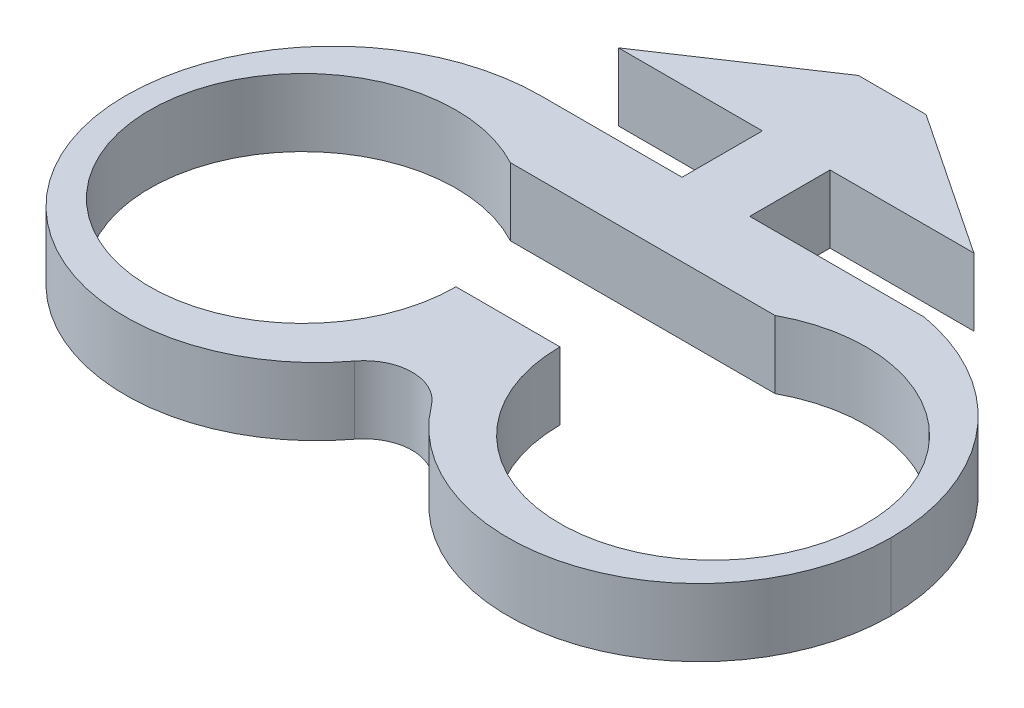
ISO-10303-21;
HEADER;
FILE_DESCRIPTION(('STEP AP214'),'2;1');
FILE_NAME('part.step','',(''),(''),'','','');
FILE_SCHEMA(('AUTOMOTIVE_DESIGN { 1 0 10303 214 1 1 1 1 }'));
ENDSEC;
DATA;
#1=APPLICATION_CONTEXT('core data for automotive mechanical design processes');
#2=APPLICATION_PROTOCOL_DEFINITION('international standard','automotive_design',2000,#1);
#3=PRODUCT_CONTEXT('',#1,'mechanical');
#4=PRODUCT('Part','Part','',(#3));
#5=PRODUCT_RELATED_PRODUCT_CATEGORY('part','',(#4));
#6=PRODUCT_DEFINITION_FORMATION('','',#4);
#7=PRODUCT_DEFINITION_CONTEXT('part definition',#1,'design');
#8=PRODUCT_DEFINITION('design','',#6,#7);
#9=PRODUCT_DEFINITION_SHAPE('','',#8);
#10=(LENGTH_UNIT() NAMED_UNIT(*) SI_UNIT(.MILLI.,.METRE.));
#11=(NAMED_UNIT(*) PLANE_ANGLE_UNIT() SI_UNIT($,.RADIAN.));
#12=(NAMED_UNIT(*) SI_UNIT($,.STERADIAN.) SOLID_ANGLE_UNIT());
#13=UNCERTAINTY_MEASURE_WITH_UNIT(LENGTH_MEASURE(1.E-05),#10,'distance_accuracy_value','');
#14=(GEOMETRIC_REPRESENTATION_CONTEXT(3) GLOBAL_UNCERTAINTY_ASSIGNED_CONTEXT((#13)) GLOBAL_UNIT_ASSIGNED_CONTEXT((#10,
#11,#12)) REPRESENTATION_CONTEXT('',''));
#15=CARTESIAN_POINT('',(0.,0.,0.));
#16=DIRECTION('',(0.,0.,1.));
#17=DIRECTION('',(1.,0.,0.));
#18=AXIS2_PLACEMENT_3D('',#15,#16,#17);
#19=CARTESIAN_POINT('',(0.,3.5814,2.125));
#20=DIRECTION('',(0.,0.,1.));
#21=DIRECTION('',(1.,0.,0.));
#22=AXIS2_PLACEMENT_3D('',#19,#20,#21);
#23=PLANE('',#22);
#24=DIRECTION('',(0.,1.,0.));
#25=VECTOR('',#24,1.);
#26=CARTESIAN_POINT('',(-9.2518,-0.00100000000000013,2.125));
#27=LINE('',#26,#25);
#28=CARTESIAN_POINT('',(-9.2518,0.,2.125));
#29=VERTEX_POINT('',#28);
#30=CARTESIAN_POINT('',(-9.2518,3.5814,2.125));
#31=VERTEX_POINT('',#30);
#32=EDGE_CURVE('E162',#29,#31,#27,.T.);
#33=ORIENTED_EDGE('',*,*,#32,.T.);
#34=DIRECTION('',(-1.,0.,0.));
#35=VECTOR('',#34,1.);
#36=CARTESIAN_POINT('',(0.,3.5814,2.125));
#37=LINE('',#36,#35);
#38=CARTESIAN_POINT('',(-1.7907,3.5814,2.125));
#39=VERTEX_POINT('',#38);
#40=EDGE_CURVE('E199',#39,#31,#37,.T.);
#41=ORIENTED_EDGE('',*,*,#40,.F.);
#42=DIRECTION('',(0.,-1.,0.));
#43=VECTOR('',#42,1.);
#44=CARTESIAN_POINT('',(-1.7907,3.5814,2.125));
#45=LINE('',#44,#43);
#46=CARTESIAN_POINT('',(-1.7907,0.,2.125));
#47=VERTEX_POINT('',#46);
#48=EDGE_CURVE('E186',#39,#47,#45,.T.);
#49=ORIENTED_EDGE('',*,*,#48,.T.);
#50=DIRECTION('',(-1.,0.,0.));
#51=VECTOR('',#50,1.);
#52=CARTESIAN_POINT('',(0.,0.,2.125));
#53=LINE('',#52,#51);
#54=EDGE_CURVE('E179',#47,#29,#53,.T.);
#55=ORIENTED_EDGE('',*,*,#54,.T.);
#56=EDGE_LOOP('',(#33,#41,#49,#55));
#57=FACE_BOUND('',#56,.T.);
#58=ADVANCED_FACE('F39',(#57),#23,.F.);
#59=CARTESIAN_POINT('',(0.,3.5814,2.125));
#60=DIRECTION('',(0.,0.,-1.));
#61=DIRECTION('',(-1.,0.,0.));
#62=AXIS2_PLACEMENT_3D('',#59,#60,#61);
#63=PLANE('',#62);
#64=DIRECTION('',(0.,1.,0.));
#65=VECTOR('',#64,1.);
#66=CARTESIAN_POINT('',(11.02035,-0.00100000000000013,2.125));
#67=LINE('',#66,#65);
#68=CARTESIAN_POINT('',(11.02035,0.,2.125));
#69=VERTEX_POINT('',#68);
#70=CARTESIAN_POINT('',(11.02035,3.5814,2.125));
#71=VERTEX_POINT('',#70);
#72=EDGE_CURVE('E184',#69,#71,#67,.T.);
#73=ORIENTED_EDGE('',*,*,#72,.F.);
#74=DIRECTION('',(1.,0.,0.));
#75=VECTOR('',#74,1.);
#76=CARTESIAN_POINT('',(0.,0.,2.125));
#77=LINE('',#76,#75);
#78=CARTESIAN_POINT('',(1.7907,0.,2.125));
#79=VERTEX_POINT('',#78);
#80=EDGE_CURVE('E225',#79,#69,#77,.T.);
#81=ORIENTED_EDGE('',*,*,#80,.F.);
#82=DIRECTION('',(0.,-1.,0.));
#83=VECTOR('',#82,1.);
#84=CARTESIAN_POINT('',(1.7907,3.5814,2.125));
#85=LINE('',#84,#83);
#86=CARTESIAN_POINT('',(1.7907,3.5814,2.125));
#87=VERTEX_POINT('',#86);
#88=EDGE_CURVE('E47',#87,#79,#85,.T.);
#89=ORIENTED_EDGE('',*,*,#88,.F.);
#90=DIRECTION('',(1.,0.,0.));
#91=VECTOR('',#90,1.);
#92=CARTESIAN_POINT('',(0.,3.5814,2.125));
#93=LINE('',#92,#91);
#94=EDGE_CURVE('E187',#87,#71,#93,.T.);
#95=ORIENTED_EDGE('',*,*,#94,.T.);
#96=EDGE_LOOP('',(#73,#81,#89,#95));
#97=FACE_BOUND('',#96,.T.);
#98=ADVANCED_FACE('F41',(#97),#63,.T.);
#99=CARTESIAN_POINT('',(1.7907,3.5814,0.));
#100=DIRECTION('',(-1.,0.,0.));
#101=DIRECTION('',(0.,0.,1.));
#102=AXIS2_PLACEMENT_3D('',#99,#100,#101);
#103=PLANE('',#102);
#104=DIRECTION('',(0.,0.,-1.));
#105=VECTOR('',#104,1.);
#106=CARTESIAN_POINT('',(1.7907,0.,0.));
#107=LINE('',#106,#105);
#108=CARTESIAN_POINT('',(1.7907,0.,-2.125));
#109=VERTEX_POINT('',#108);
#110=EDGE_CURVE('E218',#79,#109,#107,.T.);
#111=ORIENTED_EDGE('',*,*,#110,.T.);
#112=DIRECTION('',(0.,-1.,0.));
#113=VECTOR('',#112,1.);
#114=CARTESIAN_POINT('',(1.7907,3.5814,-2.125));
#115=LINE('',#114,#113);
#116=CARTESIAN_POINT('',(1.7907,3.5814,-2.125));
#117=VERTEX_POINT('',#116);
#118=EDGE_CURVE('E211',#117,#109,#115,.T.);
#119=ORIENTED_EDGE('',*,*,#118,.F.);
#120=DIRECTION('',(0.,0.,-1.));
#121=VECTOR('',#120,1.);
#122=CARTESIAN_POINT('',(1.7907,3.5814,0.));
#123=LINE('',#122,#121);
#124=EDGE_CURVE('E191',#87,#117,#123,.T.);
#125=ORIENTED_EDGE('',*,*,#124,.F.);
#126=ORIENTED_EDGE('',*,*,#88,.T.);
#127=EDGE_LOOP('',(#111,#119,#125,#126));
#128=FACE_BOUND('',#127,.T.);
#129=ADVANCED_FACE('F216',(#128),#103,.F.);
#130=CARTESIAN_POINT('',(0.,3.5814,-2.125));
#131=DIRECTION('',(0.,0.,1.));
#132=DIRECTION('',(1.,0.,0.));
#133=AXIS2_PLACEMENT_3D('',#130,#131,#132);
#134=PLANE('',#133);
#135=DIRECTION('',(-1.,0.,0.));
#136=VECTOR('',#135,1.);
#137=CARTESIAN_POINT('',(0.,0.,-2.125));
#138=LINE('',#137,#136);
#139=CARTESIAN_POINT('',(9.398,0.,-2.125));
#140=VERTEX_POINT('',#139);
#141=EDGE_CURVE('E228',#140,#109,#138,.T.);
#142=ORIENTED_EDGE('',*,*,#141,.F.);
#143=DIRECTION('',(0.,-1.,0.));
#144=VECTOR('',#143,1.);
#145=CARTESIAN_POINT('',(9.398,3.5814,-2.125));
#146=LINE('',#145,#144);
#147=CARTESIAN_POINT('',(9.398,3.5814,-2.125));
#148=VERTEX_POINT('',#147);
#149=EDGE_CURVE('E209',#148,#140,#146,.T.);
#150=ORIENTED_EDGE('',*,*,#149,.F.);
#151=DIRECTION('',(-1.,0.,0.));
#152=VECTOR('',#151,1.);
#153=CARTESIAN_POINT('',(0.,3.5814,-2.125));
#154=LINE('',#153,#152);
#155=EDGE_CURVE('E274',#148,#117,#154,.T.);
#156=ORIENTED_EDGE('',*,*,#155,.T.);
#157=ORIENTED_EDGE('',*,*,#118,.T.);
#158=EDGE_LOOP('',(#142,#150,#156,#157));
#159=FACE_BOUND('',#158,.T.);
#160=ADVANCED_FACE('F273',(#159),#134,.T.);
#161=CARTESIAN_POINT('',(3.87977278378415,3.5814,-5.80995974371676));
#162=DIRECTION('',(0.555340809590661,0.,-0.831622862362014));
#163=DIRECTION('',(-0.831622862362014,0.,-0.555340809590661));
#164=AXIS2_PLACEMENT_3D('',#161,#162,#163);
#165=PLANE('',#164);
#166=DIRECTION('',(0.831622862362014,0.,0.555340809590661));
#167=VECTOR('',#166,1.);
#168=CARTESIAN_POINT('',(3.87977278378415,0.,-5.80995974371676));
#169=LINE('',#168,#167);
#170=CARTESIAN_POINT('',(1.7907,0.,-7.205));
#171=VERTEX_POINT('',#170);
#172=EDGE_CURVE('E239',#171,#140,#169,.T.);
#173=ORIENTED_EDGE('',*,*,#172,.F.);
#174=DIRECTION('',(0.,-1.,0.));
#175=VECTOR('',#174,1.);
#176=CARTESIAN_POINT('',(1.7907,3.5814,-7.205));
#177=LINE('',#176,#175);
#178=CARTESIAN_POINT('',(1.7907,3.5814,-7.205));
#179=VERTEX_POINT('',#178);
#180=EDGE_CURVE('E207',#179,#171,#177,.T.);
#181=ORIENTED_EDGE('',*,*,#180,.F.);
#182=DIRECTION('',(0.831622862362014,0.,0.555340809590661));
#183=VECTOR('',#182,1.);
#184=CARTESIAN_POINT('',(3.87977278378415,3.5814,-5.80995974371676));
#185=LINE('',#184,#183);
#186=EDGE_CURVE('E269',#179,#148,#185,.T.);
#187=ORIENTED_EDGE('',*,*,#186,.T.);
#188=ORIENTED_EDGE('',*,*,#149,.T.);
#189=EDGE_LOOP('',(#173,#181,#187,#188));
#190=FACE_BOUND('',#189,.T.);
#191=ADVANCED_FACE('F266',(#190),#165,.T.);
#192=CARTESIAN_POINT('',(0.,3.5814,-7.205));
#193=DIRECTION('',(0.,0.,-1.));
#194=DIRECTION('',(-1.,0.,0.));
#195=AXIS2_PLACEMENT_3D('',#192,#193,#194);
#196=PLANE('',#195);
#197=DIRECTION('',(1.,0.,0.));
#198=VECTOR('',#197,1.);
#199=CARTESIAN_POINT('',(0.,0.,-7.205));
#200=LINE('',#199,#198);
#201=CARTESIAN_POINT('',(-1.7907,0.,-7.205));
#202=VERTEX_POINT('',#201);
#203=EDGE_CURVE('E241',#202,#171,#200,.T.);
#204=ORIENTED_EDGE('',*,*,#203,.F.);
#205=DIRECTION('',(0.,-1.,0.));
#206=VECTOR('',#205,1.);
#207=CARTESIAN_POINT('',(-1.7907,3.5814,-7.205));
#208=LINE('',#207,#206);
#209=CARTESIAN_POINT('',(-1.7907,3.5814,-7.205));
#210=VERTEX_POINT('',#209);
#211=EDGE_CURVE('E205',#210,#202,#208,.T.);
#212=ORIENTED_EDGE('',*,*,#211,.F.);
#213=DIRECTION('',(1.,0.,0.));
#214=VECTOR('',#213,1.);
#215=CARTESIAN_POINT('',(0.,3.5814,-7.205));
#216=LINE('',#215,#214);
#217=EDGE_CURVE('E277',#210,#179,#216,.T.);
#218=ORIENTED_EDGE('',*,*,#217,.T.);
#219=ORIENTED_EDGE('',*,*,#180,.T.);
#220=EDGE_LOOP('',(#204,#212,#218,#219));
#221=FACE_BOUND('',#220,.T.);
#222=ADVANCED_FACE('F263',(#221),#196,.T.);
#223=CARTESIAN_POINT('',(-3.87977278378415,3.5814,-5.80995974371676));
#224=DIRECTION('',(-0.555340809590661,0.,-0.831622862362014));
#225=DIRECTION('',(-0.831622862362014,0.,0.555340809590661));
#226=AXIS2_PLACEMENT_3D('',#223,#224,#225);
#227=PLANE('',#226);
#228=DIRECTION('',(0.831622862362014,0.,-0.555340809590661));
#229=VECTOR('',#228,1.);
#230=CARTESIAN_POINT('',(-3.87977278378415,0.,-5.80995974371676));
#231=LINE('',#230,#229);
#232=CARTESIAN_POINT('',(-9.398,0.,-2.125));
#233=VERTEX_POINT('',#232);
#234=EDGE_CURVE('E244',#233,#202,#231,.T.);
#235=ORIENTED_EDGE('',*,*,#234,.F.);
#236=DIRECTION('',(0.,-1.,0.));
#237=VECTOR('',#236,1.);
#238=CARTESIAN_POINT('',(-9.398,3.5814,-2.125));
#239=LINE('',#238,#237);
#240=CARTESIAN_POINT('',(-9.398,3.5814,-2.125));
#241=VERTEX_POINT('',#240);
#242=EDGE_CURVE('E203',#241,#233,#239,.T.);
#243=ORIENTED_EDGE('',*,*,#242,.F.);
#244=DIRECTION('',(0.831622862362014,0.,-0.555340809590661));
#245=VECTOR('',#244,1.);
#246=CARTESIAN_POINT('',(-3.87977278378415,3.5814,-5.80995974371676));
#247=LINE('',#246,#245);
#248=EDGE_CURVE('E259',#241,#210,#247,.T.);
#249=ORIENTED_EDGE('',*,*,#248,.T.);
#250=ORIENTED_EDGE('',*,*,#211,.T.);
#251=EDGE_LOOP('',(#235,#243,#249,#250));
#252=FACE_BOUND('',#251,.T.);
#253=ADVANCED_FACE('F257',(#252),#227,.T.);
#254=CARTESIAN_POINT('',(0.,3.5814,-2.125));
#255=DIRECTION('',(0.,0.,1.));
#256=DIRECTION('',(1.,0.,0.));
#257=AXIS2_PLACEMENT_3D('',#254,#255,#256);
#258=PLANE('',#257);
#259=DIRECTION('',(-1.,0.,0.));
#260=VECTOR('',#259,1.);
#261=CARTESIAN_POINT('',(0.,0.,-2.125));
#262=LINE('',#261,#260);
#263=CARTESIAN_POINT('',(-1.7907,0.,-2.125));
#264=VERTEX_POINT('',#263);
#265=EDGE_CURVE('E193',#264,#233,#262,.T.);
#266=ORIENTED_EDGE('',*,*,#265,.F.);
#267=DIRECTION('',(0.,-1.,0.));
#268=VECTOR('',#267,1.);
#269=CARTESIAN_POINT('',(-1.7907,3.5814,-2.125));
#270=LINE('',#269,#268);
#271=CARTESIAN_POINT('',(-1.7907,3.5814,-2.125));
#272=VERTEX_POINT('',#271);
#273=EDGE_CURVE('E201',#272,#264,#270,.T.);
#274=ORIENTED_EDGE('',*,*,#273,.F.);
#275=DIRECTION('',(-1.,0.,0.));
#276=VECTOR('',#275,1.);
#277=CARTESIAN_POINT('',(0.,3.5814,-2.125));
#278=LINE('',#277,#276);
#279=EDGE_CURVE('E253',#272,#241,#278,.T.);
#280=ORIENTED_EDGE('',*,*,#279,.T.);
#281=ORIENTED_EDGE('',*,*,#242,.T.);
#282=EDGE_LOOP('',(#266,#274,#280,#281));
#283=FACE_BOUND('',#282,.T.);
#284=ADVANCED_FACE('F250',(#283),#258,.T.);
#285=CARTESIAN_POINT('',(-1.7907,3.5814,0.));
#286=DIRECTION('',(-1.,0.,0.));
#287=DIRECTION('',(0.,0.,1.));
#288=AXIS2_PLACEMENT_3D('',#285,#286,#287);
#289=PLANE('',#288);
#290=DIRECTION('',(0.,0.,-1.));
#291=VECTOR('',#290,1.);
#292=CARTESIAN_POINT('',(-1.7907,0.,0.));
#293=LINE('',#292,#291);
#294=EDGE_CURVE('E188',#47,#264,#293,.T.);
#295=ORIENTED_EDGE('',*,*,#294,.F.);
#296=ORIENTED_EDGE('',*,*,#48,.F.);
#297=DIRECTION('',(0.,0.,-1.));
#298=VECTOR('',#297,1.);
#299=CARTESIAN_POINT('',(-1.7907,3.5814,0.));
#300=LINE('',#299,#298);
#301=EDGE_CURVE('E283',#39,#272,#300,.T.);
#302=ORIENTED_EDGE('',*,*,#301,.T.);
#303=ORIENTED_EDGE('',*,*,#273,.T.);
#304=EDGE_LOOP('',(#295,#296,#302,#303));
#305=FACE_BOUND('',#304,.T.);
#306=ADVANCED_FACE('F377',(#305),#289,.T.);
#307=CARTESIAN_POINT('',(0.,3.5814,0.));
#308=DIRECTION('',(0.,1.,0.));
#309=DIRECTION('',(0.,0.,1.));
#310=AXIS2_PLACEMENT_3D('',#307,#308,#309);
#311=PLANE('',#310);
#312=CARTESIAN_POINT('',(-9.2518,3.5814,13.1232));
#313=DIRECTION('',(0.,-1.,0.));
#314=DIRECTION('',(0.,0.,1.));
#315=AXIS2_PLACEMENT_3D('',#312,#313,#314);
#316=CIRCLE('',#315,10.9982);
#317=CARTESIAN_POINT('',(-20.25,3.5814,13.1232));
#318=VERTEX_POINT('',#317);
#319=EDGE_CURVE('E168',#318,#31,#316,.T.);
#320=ORIENTED_EDGE('',*,*,#319,.F.);
#321=CARTESIAN_POINT('',(-10.125,3.5814,13.1232));
#322=DIRECTION('',(0.,1.,0.));
#323=DIRECTION('',(0.,0.,1.));
#324=AXIS2_PLACEMENT_3D('',#321,#322,#323);
#325=CIRCLE('',#324,10.125);
#326=CARTESIAN_POINT('',(-2.03059613106988,3.5814,19.2056543571365));
#327=VERTEX_POINT('',#326);
#328=EDGE_CURVE('E292',#318,#327,#325,.T.);
#329=ORIENTED_EDGE('',*,*,#328,.T.);
#330=CARTESIAN_POINT('',(0.,3.5814,20.7315243884577));
#331=DIRECTION('',(0.,1.,0.));
#332=DIRECTION('',(0.,0.,1.));
#333=AXIS2_PLACEMENT_3D('',#330,#331,#332);
#334=CIRCLE('',#333,2.54);
#335=CARTESIAN_POINT('',(2.03059613106987,3.5814,19.2056543571365));
#336=VERTEX_POINT('',#335);
#337=EDGE_CURVE('E304',#336,#327,#334,.T.);
#338=ORIENTED_EDGE('',*,*,#337,.F.);
#339=CARTESIAN_POINT('',(10.125,3.5814,13.1232));
#340=DIRECTION('',(0.,1.,0.));
#341=DIRECTION('',(0.,0.,1.));
#342=AXIS2_PLACEMENT_3D('',#339,#340,#341);
#343=CIRCLE('',#342,10.125);
#344=CARTESIAN_POINT('',(20.25,3.5814,13.1232));
#345=VERTEX_POINT('',#344);
#346=EDGE_CURVE('E300',#336,#345,#343,.T.);
#347=ORIENTED_EDGE('',*,*,#346,.T.);
#348=CARTESIAN_POINT('',(9.0823586288483,3.5814,13.1232));
#349=DIRECTION('',(0.,-1.,0.));
#350=DIRECTION('',(0.,0.,1.));
#351=AXIS2_PLACEMENT_3D('',#348,#349,#350);
#352=CIRCLE('',#351,11.1676413711517);
#353=EDGE_CURVE('E348',#71,#345,#352,.T.);
#354=ORIENTED_EDGE('',*,*,#353,.F.);
#355=ORIENTED_EDGE('',*,*,#94,.F.);
#356=ORIENTED_EDGE('',*,*,#124,.T.);
#357=ORIENTED_EDGE('',*,*,#155,.F.);
#358=ORIENTED_EDGE('',*,*,#186,.F.);
#359=ORIENTED_EDGE('',*,*,#217,.F.);
#360=ORIENTED_EDGE('',*,*,#248,.F.);
#361=ORIENTED_EDGE('',*,*,#279,.F.);
#362=ORIENTED_EDGE('',*,*,#301,.F.);
#363=ORIENTED_EDGE('',*,*,#40,.T.);
#364=EDGE_LOOP('',(#320,#329,#338,#347,#354,#355,#356,#357,#358,#359,#360,#361,#362,#363));
#365=FACE_BOUND('',#364,.T.);
#366=DIRECTION('',(1.,0.,0.));
#367=VECTOR('',#366,1.);
#368=CARTESIAN_POINT('',(-2.75,3.5814,13.1232));
#369=LINE('',#368,#367);
#370=CARTESIAN_POINT('',(-2.75,3.5814,13.1232));
#371=VERTEX_POINT('',#370);
#372=CARTESIAN_POINT('',(2.75000000000001,3.5814,13.1232));
#373=VERTEX_POINT('',#372);
#374=EDGE_CURVE('E343',#371,#373,#369,.T.);
#375=ORIENTED_EDGE('',*,*,#374,.F.);
#376=CARTESIAN_POINT('',(-10.85,3.5814,13.1232));
#377=DIRECTION('',(0.,1.,0.));
#378=DIRECTION('',(0.,0.,1.));
#379=AXIS2_PLACEMENT_3D('',#376,#377,#378);
#380=CIRCLE('',#379,8.1);
#381=CARTESIAN_POINT('',(-6.99999999999999,3.5814,5.99666507761314));
#382=VERTEX_POINT('',#381);
#383=EDGE_CURVE('E317',#382,#371,#380,.T.);
#384=ORIENTED_EDGE('',*,*,#383,.F.);
#385=DIRECTION('',(-1.,0.,0.));
#386=VECTOR('',#385,1.);
#387=CARTESIAN_POINT('',(7.00000000000001,3.5814,5.99666507761314));
#388=LINE('',#387,#386);
#389=CARTESIAN_POINT('',(7.00000000000001,3.5814,5.99666507761314));
#390=VERTEX_POINT('',#389);
#391=EDGE_CURVE('E54',#390,#382,#388,.T.);
#392=ORIENTED_EDGE('',*,*,#391,.F.);
#393=CARTESIAN_POINT('',(10.85,3.5814,13.1232));
#394=DIRECTION('',(0.,1.,0.));
#395=DIRECTION('',(0.,0.,1.));
#396=AXIS2_PLACEMENT_3D('',#393,#394,#395);
#397=CIRCLE('',#396,8.09999999999999);
#398=EDGE_CURVE('E312',#373,#390,#397,.T.);
#399=ORIENTED_EDGE('',*,*,#398,.F.);
#400=EDGE_LOOP('',(#375,#384,#392,#399));
#401=FACE_BOUND('',#400,.T.);
#402=ADVANCED_FACE('F287',(#365,#401),#311,.T.);
#403=CARTESIAN_POINT('',(0.,0.,0.));
#404=DIRECTION('',(0.,1.,0.));
#405=DIRECTION('',(0.,0.,1.));
#406=AXIS2_PLACEMENT_3D('',#403,#404,#405);
#407=PLANE('',#406);
#408=CARTESIAN_POINT('',(-10.85,0.,13.1232));
#409=DIRECTION('',(0.,1.,0.));
#410=DIRECTION('',(0.,0.,1.));
#411=AXIS2_PLACEMENT_3D('',#408,#409,#410);
#412=CIRCLE('',#411,8.1);
#413=CARTESIAN_POINT('',(-6.99999999999999,0.,5.99666507761314));
#414=VERTEX_POINT('',#413);
#415=CARTESIAN_POINT('',(-2.75,0.,13.1232));
#416=VERTEX_POINT('',#415);
#417=EDGE_CURVE('E314',#414,#416,#412,.T.);
#418=ORIENTED_EDGE('',*,*,#417,.T.);
#419=DIRECTION('',(-1.,0.,0.));
#420=VECTOR('',#419,1.);
#421=CARTESIAN_POINT('',(-2.75,0.,13.1232));
#422=LINE('',#421,#420);
#423=CARTESIAN_POINT('',(2.75000000000001,0.,13.1232));
#424=VERTEX_POINT('',#423);
#425=EDGE_CURVE('E62',#424,#416,#422,.T.);
#426=ORIENTED_EDGE('',*,*,#425,.F.);
#427=CARTESIAN_POINT('',(10.85,0.,13.1232));
#428=DIRECTION('',(0.,1.,0.));
#429=DIRECTION('',(0.,0.,1.));
#430=AXIS2_PLACEMENT_3D('',#427,#428,#429);
#431=CIRCLE('',#430,8.09999999999999);
#432=CARTESIAN_POINT('',(7.00000000000001,0.,5.99666507761314));
#433=VERTEX_POINT('',#432);
#434=EDGE_CURVE('E323',#424,#433,#431,.T.);
#435=ORIENTED_EDGE('',*,*,#434,.T.);
#436=DIRECTION('',(1.,0.,0.));
#437=VECTOR('',#436,1.);
#438=CARTESIAN_POINT('',(7.00000000000001,0.,5.99666507761314));
#439=LINE('',#438,#437);
#440=EDGE_CURVE('E173',#414,#433,#439,.T.);
#441=ORIENTED_EDGE('',*,*,#440,.F.);
#442=EDGE_LOOP('',(#418,#426,#435,#441));
#443=FACE_BOUND('',#442,.T.);
#444=CARTESIAN_POINT('',(-10.125,0.,13.1232));
#445=DIRECTION('',(0.,1.,0.));
#446=DIRECTION('',(0.,0.,1.));
#447=AXIS2_PLACEMENT_3D('',#444,#445,#446);
#448=CIRCLE('',#447,10.125);
#449=CARTESIAN_POINT('',(-2.03059613106988,0.,19.2056543571365));
#450=VERTEX_POINT('',#449);
#451=CARTESIAN_POINT('',(-20.25,0.,13.1232));
#452=VERTEX_POINT('',#451);
#453=EDGE_CURVE('E182',#450,#452,#448,.F.);
#454=ORIENTED_EDGE('',*,*,#453,.T.);
#455=CARTESIAN_POINT('',(-9.2518,0.,13.1232));
#456=DIRECTION('',(0.,1.,0.));
#457=DIRECTION('',(0.,0.,1.));
#458=AXIS2_PLACEMENT_3D('',#455,#456,#457);
#459=CIRCLE('',#458,10.9982);
#460=EDGE_CURVE('E165',#29,#452,#459,.T.);
#461=ORIENTED_EDGE('',*,*,#460,.F.);
#462=ORIENTED_EDGE('',*,*,#54,.F.);
#463=ORIENTED_EDGE('',*,*,#294,.T.);
#464=ORIENTED_EDGE('',*,*,#265,.T.);
#465=ORIENTED_EDGE('',*,*,#234,.T.);
#466=ORIENTED_EDGE('',*,*,#203,.T.);
#467=ORIENTED_EDGE('',*,*,#172,.T.);
#468=ORIENTED_EDGE('',*,*,#141,.T.);
#469=ORIENTED_EDGE('',*,*,#110,.F.);
#470=ORIENTED_EDGE('',*,*,#80,.T.);
#471=CARTESIAN_POINT('',(9.0823586288483,0.,13.1232));
#472=DIRECTION('',(0.,1.,0.));
#473=DIRECTION('',(0.,0.,1.));
#474=AXIS2_PLACEMENT_3D('',#471,#472,#473);
#475=CIRCLE('',#474,11.1676413711517);
#476=CARTESIAN_POINT('',(20.25,0.,13.1232));
#477=VERTEX_POINT('',#476);
#478=EDGE_CURVE('E350',#477,#69,#475,.T.);
#479=ORIENTED_EDGE('',*,*,#478,.F.);
#480=CARTESIAN_POINT('',(10.125,0.,13.1232));
#481=DIRECTION('',(0.,1.,0.));
#482=DIRECTION('',(0.,0.,1.));
#483=AXIS2_PLACEMENT_3D('',#480,#481,#482);
#484=CIRCLE('',#483,10.125);
#485=CARTESIAN_POINT('',(2.03059613106987,0.,19.2056543571365));
#486=VERTEX_POINT('',#485);
#487=EDGE_CURVE('E231',#477,#486,#484,.F.);
#488=ORIENTED_EDGE('',*,*,#487,.T.);
#489=CARTESIAN_POINT('',(0.,0.,20.7315243884577));
#490=DIRECTION('',(0.,1.,0.));
#491=DIRECTION('',(0.,0.,1.));
#492=AXIS2_PLACEMENT_3D('',#489,#490,#491);
#493=CIRCLE('',#492,2.54);
#494=EDGE_CURVE('E233',#450,#486,#493,.F.);
#495=ORIENTED_EDGE('',*,*,#494,.F.);
#496=EDGE_LOOP('',(#454,#461,#462,#463,#464,#465,#466,#467,#468,#469,#470,#479,#488,#495));
#497=FACE_BOUND('',#496,.T.);
#498=ADVANCED_FACE('F177',(#443,#497),#407,.F.);
#499=CARTESIAN_POINT('',(0.,-41.7464444593788,20.7315243884577));
#500=DIRECTION('',(0.,1.,0.));
#501=DIRECTION('',(0.,0.,1.));
#502=AXIS2_PLACEMENT_3D('',#499,#500,#501);
#503=CYLINDRICAL_SURFACE('',#502,2.54);
#504=DIRECTION('',(0.,1.,0.));
#505=VECTOR('',#504,1.);
#506=CARTESIAN_POINT('',(-2.03059613106988,-41.7464444593788,19.2056543571365));
#507=LINE('',#506,#505);
#508=EDGE_CURVE('E297',#450,#327,#507,.T.);
#509=ORIENTED_EDGE('',*,*,#508,.F.);
#510=ORIENTED_EDGE('',*,*,#494,.T.);
#511=DIRECTION('',(0.,1.,0.));
#512=VECTOR('',#511,1.);
#513=CARTESIAN_POINT('',(2.03059613106987,-41.7464444593788,19.2056543571365));
#514=LINE('',#513,#512);
#515=EDGE_CURVE('E299',#486,#336,#514,.T.);
#516=ORIENTED_EDGE('',*,*,#515,.T.);
#517=ORIENTED_EDGE('',*,*,#337,.T.);
#518=EDGE_LOOP('',(#509,#510,#516,#517));
#519=FACE_BOUND('',#518,.T.);
#520=ADVANCED_FACE('F360',(#519),#503,.F.);
#521=CARTESIAN_POINT('',(-10.125,-41.7464444593788,13.1232));
#522=DIRECTION('',(0.,1.,0.));
#523=DIRECTION('',(0.,0.,1.));
#524=AXIS2_PLACEMENT_3D('',#521,#522,#523);
#525=CYLINDRICAL_SURFACE('',#524,10.125);
#526=ORIENTED_EDGE('',*,*,#453,.F.);
#527=ORIENTED_EDGE('',*,*,#508,.T.);
#528=ORIENTED_EDGE('',*,*,#328,.F.);
#529=DIRECTION('',(0.,-1.,0.));
#530=VECTOR('',#529,1.);
#531=CARTESIAN_POINT('',(-20.25,3.5814,13.1232));
#532=LINE('',#531,#530);
#533=EDGE_CURVE('E197',#318,#452,#532,.T.);
#534=ORIENTED_EDGE('',*,*,#533,.T.);
#535=EDGE_LOOP('',(#526,#527,#528,#534));
#536=FACE_BOUND('',#535,.T.);
#537=ADVANCED_FACE('F295',(#536),#525,.T.);
#538=CARTESIAN_POINT('',(10.125,-41.7464444593788,13.1232));
#539=DIRECTION('',(0.,1.,0.));
#540=DIRECTION('',(0.,0.,1.));
#541=AXIS2_PLACEMENT_3D('',#538,#539,#540);
#542=CYLINDRICAL_SURFACE('',#541,10.125);
#543=ORIENTED_EDGE('',*,*,#487,.F.);
#544=DIRECTION('',(0.,-1.,0.));
#545=VECTOR('',#544,1.);
#546=CARTESIAN_POINT('',(20.25,3.5814,13.1232));
#547=LINE('',#546,#545);
#548=EDGE_CURVE('E11',#345,#477,#547,.T.);
#549=ORIENTED_EDGE('',*,*,#548,.F.);
#550=ORIENTED_EDGE('',*,*,#346,.F.);
#551=ORIENTED_EDGE('',*,*,#515,.F.);
#552=EDGE_LOOP('',(#543,#549,#550,#551));
#553=FACE_BOUND('',#552,.T.);
#554=ADVANCED_FACE('F358',(#553),#542,.T.);
#555=CARTESIAN_POINT('',(10.85,0.,13.1232));
#556=DIRECTION('',(0.,1.,0.));
#557=DIRECTION('',(0.,0.,1.));
#558=AXIS2_PLACEMENT_3D('',#555,#556,#557);
#559=CYLINDRICAL_SURFACE('',#558,8.09999999999999);
#560=ORIENTED_EDGE('',*,*,#434,.F.);
#561=DIRECTION('',(0.,1.,0.));
#562=VECTOR('',#561,1.);
#563=CARTESIAN_POINT('',(2.75000000000001,-0.00100000000000013,13.1232));
#564=LINE('',#563,#562);
#565=EDGE_CURVE('E326',#424,#373,#564,.T.);
#566=ORIENTED_EDGE('',*,*,#565,.T.);
#567=ORIENTED_EDGE('',*,*,#398,.T.);
#568=DIRECTION('',(0.,1.,0.));
#569=VECTOR('',#568,1.);
#570=CARTESIAN_POINT('',(7.00000000000001,-0.00100000000000013,5.99666507761314));
#571=LINE('',#570,#569);
#572=EDGE_CURVE('E339',#433,#390,#571,.T.);
#573=ORIENTED_EDGE('',*,*,#572,.F.);
#574=EDGE_LOOP('',(#560,#566,#567,#573));
#575=FACE_BOUND('',#574,.T.);
#576=ADVANCED_FACE('F445',(#575),#559,.F.);
#577=CARTESIAN_POINT('',(-10.85,0.,13.1232));
#578=DIRECTION('',(0.,1.,0.));
#579=DIRECTION('',(0.,0.,1.));
#580=AXIS2_PLACEMENT_3D('',#577,#578,#579);
#581=CYLINDRICAL_SURFACE('',#580,8.1);
#582=ORIENTED_EDGE('',*,*,#383,.T.);
#583=DIRECTION('',(0.,1.,0.));
#584=VECTOR('',#583,1.);
#585=CARTESIAN_POINT('',(-2.75,-0.00100000000000013,13.1232));
#586=LINE('',#585,#584);
#587=EDGE_CURVE('E331',#416,#371,#586,.T.);
#588=ORIENTED_EDGE('',*,*,#587,.F.);
#589=ORIENTED_EDGE('',*,*,#417,.F.);
#590=DIRECTION('',(0.,1.,0.));
#591=VECTOR('',#590,1.);
#592=CARTESIAN_POINT('',(-6.99999999999999,-0.00100000000000013,5.99666507761314));
#593=LINE('',#592,#591);
#594=EDGE_CURVE('E336',#414,#382,#593,.T.);
#595=ORIENTED_EDGE('',*,*,#594,.T.);
#596=EDGE_LOOP('',(#582,#588,#589,#595));
#597=FACE_BOUND('',#596,.T.);
#598=ADVANCED_FACE('F492',(#597),#581,.F.);
#599=CARTESIAN_POINT('',(7.00000000000001,-0.00100000000000013,5.99666507761314));
#600=DIRECTION('',(0.,0.,-1.));
#601=DIRECTION('',(-1.,0.,0.));
#602=AXIS2_PLACEMENT_3D('',#599,#600,#601);
#603=PLANE('',#602);
#604=ORIENTED_EDGE('',*,*,#440,.T.);
#605=ORIENTED_EDGE('',*,*,#572,.T.);
#606=ORIENTED_EDGE('',*,*,#391,.T.);
#607=ORIENTED_EDGE('',*,*,#594,.F.);
#608=EDGE_LOOP('',(#604,#605,#606,#607));
#609=FACE_BOUND('',#608,.T.);
#610=ADVANCED_FACE('F484',(#609),#603,.F.);
#611=CARTESIAN_POINT('',(-2.75,-0.00100000000000013,13.1232));
#612=DIRECTION('',(0.,0.,1.));
#613=DIRECTION('',(1.,0.,0.));
#614=AXIS2_PLACEMENT_3D('',#611,#612,#613);
#615=PLANE('',#614);
#616=ORIENTED_EDGE('',*,*,#425,.T.);
#617=ORIENTED_EDGE('',*,*,#587,.T.);
#618=ORIENTED_EDGE('',*,*,#374,.T.);
#619=ORIENTED_EDGE('',*,*,#565,.F.);
#620=EDGE_LOOP('',(#616,#617,#618,#619));
#621=FACE_BOUND('',#620,.T.);
#622=ADVANCED_FACE('F456',(#621),#615,.F.);
#623=CARTESIAN_POINT('',(9.0823586288483,-0.00100000000000013,13.1232));
#624=DIRECTION('',(0.,1.,0.));
#625=DIRECTION('',(0.,0.,1.));
#626=AXIS2_PLACEMENT_3D('',#623,#624,#625);
#627=CYLINDRICAL_SURFACE('',#626,11.1676413711517);
#628=ORIENTED_EDGE('',*,*,#478,.T.);
#629=ORIENTED_EDGE('',*,*,#72,.T.);
#630=ORIENTED_EDGE('',*,*,#353,.T.);
#631=ORIENTED_EDGE('',*,*,#548,.T.);
#632=EDGE_LOOP('',(#628,#629,#630,#631));
#633=FACE_BOUND('',#632,.T.);
#634=ADVANCED_FACE('F352',(#633),#627,.T.);
#635=CARTESIAN_POINT('',(-9.2518,-0.00100000000000013,13.1232));
#636=DIRECTION('',(0.,1.,0.));
#637=DIRECTION('',(0.,0.,1.));
#638=AXIS2_PLACEMENT_3D('',#635,#636,#637);
#639=CYLINDRICAL_SURFACE('',#638,10.9982);
#640=ORIENTED_EDGE('',*,*,#460,.T.);
#641=ORIENTED_EDGE('',*,*,#533,.F.);
#642=ORIENTED_EDGE('',*,*,#319,.T.);
#643=ORIENTED_EDGE('',*,*,#32,.F.);
#644=EDGE_LOOP('',(#640,#641,#642,#643));
#645=FACE_BOUND('',#644,.T.);
#646=ADVANCED_FACE('F164',(#645),#639,.T.);
#647=CLOSED_SHELL('',(#58,#98,#129,#160,#191,#222,#253,#284,#306,#402,#498,#520,#537,#554,#576,
#598,#610,#622,#634,#646));
#648=MANIFOLD_SOLID_BREP('B2',#647);
#649=ADVANCED_BREP_SHAPE_REPRESENTATION('',(#18,#648),#14);
#650=SHAPE_DEFINITION_REPRESENTATION(#9,#649);
ENDSEC;
END-ISO-10303-21;
